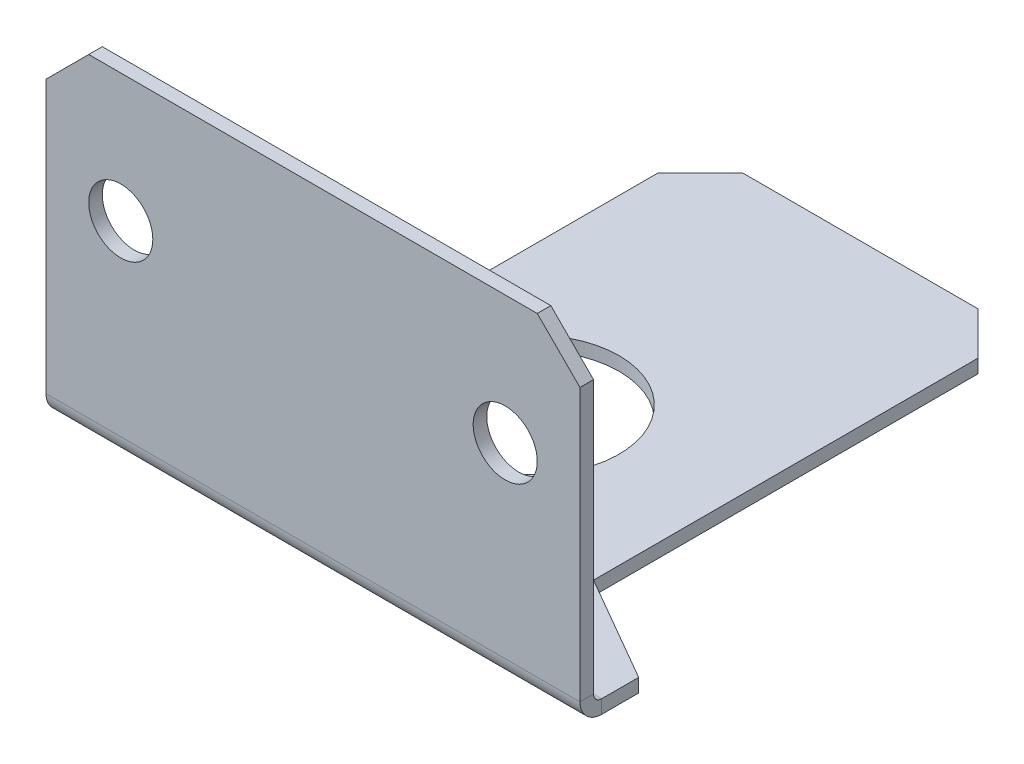
ISO-10303-21;
HEADER;
FILE_DESCRIPTION(('STEP AP214'),'2;1');
FILE_NAME('part.step','',(''),(''),'','','');
FILE_SCHEMA(('AUTOMOTIVE_DESIGN { 1 0 10303 214 1 1 1 1 }'));
ENDSEC;
DATA;
#1=APPLICATION_CONTEXT('core data for automotive mechanical design processes');
#2=APPLICATION_PROTOCOL_DEFINITION('international standard','automotive_design',2000,#1);
#3=PRODUCT_CONTEXT('',#1,'mechanical');
#4=PRODUCT('Part','Part','',(#3));
#5=PRODUCT_RELATED_PRODUCT_CATEGORY('part','',(#4));
#6=PRODUCT_DEFINITION_FORMATION('','',#4);
#7=PRODUCT_DEFINITION_CONTEXT('part definition',#1,'design');
#8=PRODUCT_DEFINITION('design','',#6,#7);
#9=PRODUCT_DEFINITION_SHAPE('','',#8);
#10=(LENGTH_UNIT() NAMED_UNIT(*) SI_UNIT(.MILLI.,.METRE.));
#11=(NAMED_UNIT(*) PLANE_ANGLE_UNIT() SI_UNIT($,.RADIAN.));
#12=(NAMED_UNIT(*) SI_UNIT($,.STERADIAN.) SOLID_ANGLE_UNIT());
#13=UNCERTAINTY_MEASURE_WITH_UNIT(LENGTH_MEASURE(1.E-05),#10,'distance_accuracy_value','');
#14=(GEOMETRIC_REPRESENTATION_CONTEXT(3) GLOBAL_UNCERTAINTY_ASSIGNED_CONTEXT((#13)) GLOBAL_UNIT_ASSIGNED_CONTEXT((#10,
#11,#12)) REPRESENTATION_CONTEXT('',''));
#15=CARTESIAN_POINT('',(0.,0.,0.));
#16=DIRECTION('',(0.,0.,1.));
#17=DIRECTION('',(1.,0.,0.));
#18=AXIS2_PLACEMENT_3D('',#15,#16,#17);
#19=CARTESIAN_POINT('',(12.5,-9.12999999999999,-0.381000000000002));
#20=DIRECTION('',(1.,0.,0.));
#21=DIRECTION('',(0.,0.,-1.));
#22=AXIS2_PLACEMENT_3D('',#19,#20,#21);
#23=PLANE('',#22);
#24=DIRECTION('',(0.,-1.,0.));
#25=VECTOR('',#24,1.);
#26=CARTESIAN_POINT('',(12.5,-9.12999999999999,-0.381000000000002));
#27=LINE('',#26,#25);
#28=CARTESIAN_POINT('',(12.5,-9.12999999999999,-0.381000000000002));
#29=VERTEX_POINT('',#28);
#30=CARTESIAN_POINT('',(12.5,-9.76499999999999,-0.381000000000002));
#31=VERTEX_POINT('',#30);
#32=EDGE_CURVE('E246',#29,#31,#27,.T.);
#33=ORIENTED_EDGE('',*,*,#32,.F.);
#34=CARTESIAN_POINT('',(12.5,-8.74899999999999,-0.381000000000002));
#35=DIRECTION('',(-1.,0.,0.));
#36=DIRECTION('',(0.,0.,1.));
#37=AXIS2_PLACEMENT_3D('',#34,#35,#36);
#38=CIRCLE('',#37,0.381);
#39=CARTESIAN_POINT('',(12.5,-8.74899999999999,0.));
#40=VERTEX_POINT('',#39);
#41=EDGE_CURVE('E190',#40,#29,#38,.F.);
#42=ORIENTED_EDGE('',*,*,#41,.F.);
#43=DIRECTION('',(0.,0.,-1.));
#44=VECTOR('',#43,1.);
#45=CARTESIAN_POINT('',(12.5,-8.74899999999999,0.634999999999998));
#46=LINE('',#45,#44);
#47=CARTESIAN_POINT('',(12.5,-8.74899999999999,0.634999999999998));
#48=VERTEX_POINT('',#47);
#49=EDGE_CURVE('E243',#48,#40,#46,.T.);
#50=ORIENTED_EDGE('',*,*,#49,.F.);
#51=CARTESIAN_POINT('',(12.5,-8.74899999999999,-0.381000000000002));
#52=DIRECTION('',(1.,0.,0.));
#53=DIRECTION('',(0.,0.,-1.));
#54=AXIS2_PLACEMENT_3D('',#51,#52,#53);
#55=CIRCLE('',#54,1.016);
#56=EDGE_CURVE('E201',#48,#31,#55,.T.);
#57=ORIENTED_EDGE('',*,*,#56,.T.);
#58=EDGE_LOOP('',(#33,#42,#50,#57));
#59=FACE_BOUND('',#58,.T.);
#60=ADVANCED_FACE('F48',(#59),#23,.T.);
#61=CARTESIAN_POINT('',(12.5,-8.74899999999999,0.634999999999998));
#62=DIRECTION('',(1.,0.,0.));
#63=DIRECTION('',(0.,0.,-1.));
#64=AXIS2_PLACEMENT_3D('',#61,#62,#63);
#65=PLANE('',#64);
#66=DIRECTION('',(0.,-1.,0.));
#67=VECTOR('',#66,1.);
#68=CARTESIAN_POINT('',(12.5,-9.12999999999999,-2.11324865405187));
#69=LINE('',#68,#67);
#70=CARTESIAN_POINT('',(12.5,-9.12999999999999,-2.11324865405187));
#71=VERTEX_POINT('',#70);
#72=CARTESIAN_POINT('',(12.5,-9.76499999999999,-2.11324865405187));
#73=VERTEX_POINT('',#72);
#74=EDGE_CURVE('E165',#71,#73,#69,.T.);
#75=ORIENTED_EDGE('',*,*,#74,.F.);
#76=DIRECTION('',(0.,0.,-1.));
#77=VECTOR('',#76,1.);
#78=CARTESIAN_POINT('',(12.5,-9.12999999999999,0.));
#79=LINE('',#78,#77);
#80=EDGE_CURVE('E178',#29,#71,#79,.T.);
#81=ORIENTED_EDGE('',*,*,#80,.F.);
#82=ORIENTED_EDGE('',*,*,#32,.T.);
#83=DIRECTION('',(0.,0.,-1.));
#84=VECTOR('',#83,1.);
#85=CARTESIAN_POINT('',(12.5,-9.76499999999999,0.));
#86=LINE('',#85,#84);
#87=EDGE_CURVE('E181',#31,#73,#86,.T.);
#88=ORIENTED_EDGE('',*,*,#87,.T.);
#89=EDGE_LOOP('',(#75,#81,#82,#88));
#90=FACE_BOUND('',#89,.T.);
#91=ADVANCED_FACE('F177',(#90),#65,.T.);
#92=CARTESIAN_POINT('',(-12.5,-8.74899999999999,0.));
#93=DIRECTION('',(-1.,0.,0.));
#94=DIRECTION('',(0.,0.,1.));
#95=AXIS2_PLACEMENT_3D('',#92,#93,#94);
#96=PLANE('',#95);
#97=DIRECTION('',(0.,0.,1.));
#98=VECTOR('',#97,1.);
#99=CARTESIAN_POINT('',(-12.5,-8.74899999999999,0.));
#100=LINE('',#99,#98);
#101=CARTESIAN_POINT('',(-12.5,-8.74899999999999,0.));
#102=VERTEX_POINT('',#101);
#103=CARTESIAN_POINT('',(-12.5,-8.74899999999999,0.634999999999998));
#104=VERTEX_POINT('',#103);
#105=EDGE_CURVE('E240',#102,#104,#100,.T.);
#106=ORIENTED_EDGE('',*,*,#105,.F.);
#107=CARTESIAN_POINT('',(-12.5,-8.74899999999999,-0.381000000000002));
#108=DIRECTION('',(-1.,0.,0.));
#109=DIRECTION('',(0.,0.,1.));
#110=AXIS2_PLACEMENT_3D('',#107,#108,#109);
#111=CIRCLE('',#110,0.381);
#112=CARTESIAN_POINT('',(-12.5,-9.12999999999999,-0.381000000000002));
#113=VERTEX_POINT('',#112);
#114=EDGE_CURVE('E211',#102,#113,#111,.F.);
#115=ORIENTED_EDGE('',*,*,#114,.T.);
#116=DIRECTION('',(0.,1.,0.));
#117=VECTOR('',#116,1.);
#118=CARTESIAN_POINT('',(-12.5,-9.76499999999999,-0.381000000000002));
#119=LINE('',#118,#117);
#120=CARTESIAN_POINT('',(-12.5,-9.76499999999999,-0.381000000000002));
#121=VERTEX_POINT('',#120);
#122=EDGE_CURVE('E238',#121,#113,#119,.T.);
#123=ORIENTED_EDGE('',*,*,#122,.F.);
#124=CARTESIAN_POINT('',(-12.5,-8.74899999999999,-0.381000000000002));
#125=DIRECTION('',(1.,0.,0.));
#126=DIRECTION('',(0.,0.,-1.));
#127=AXIS2_PLACEMENT_3D('',#124,#125,#126);
#128=CIRCLE('',#127,1.016);
#129=EDGE_CURVE('E194',#104,#121,#128,.T.);
#130=ORIENTED_EDGE('',*,*,#129,.F.);
#131=EDGE_LOOP('',(#106,#115,#123,#130));
#132=FACE_BOUND('',#131,.T.);
#133=ADVANCED_FACE('F293',(#132),#96,.T.);
#134=CARTESIAN_POINT('',(-12.5,-9.76499999999999,-0.381000000000002));
#135=DIRECTION('',(-1.,0.,0.));
#136=DIRECTION('',(0.,0.,1.));
#137=AXIS2_PLACEMENT_3D('',#134,#135,#136);
#138=PLANE('',#137);
#139=DIRECTION('',(0.,-1.,0.));
#140=VECTOR('',#139,1.);
#141=CARTESIAN_POINT('',(-12.5,6.,0.635));
#142=LINE('',#141,#140);
#143=CARTESIAN_POINT('',(-12.5,4.,0.635));
#144=VERTEX_POINT('',#143);
#145=EDGE_CURVE('E216',#144,#104,#142,.T.);
#146=ORIENTED_EDGE('',*,*,#145,.F.);
#147=DIRECTION('',(0.,0.,-1.));
#148=VECTOR('',#147,1.);
#149=CARTESIAN_POINT('',(-12.5,4.,-0.381000000000002));
#150=LINE('',#149,#148);
#151=CARTESIAN_POINT('',(-12.5,4.,0.));
#152=VERTEX_POINT('',#151);
#153=EDGE_CURVE('E275',#144,#152,#150,.T.);
#154=ORIENTED_EDGE('',*,*,#153,.T.);
#155=DIRECTION('',(0.,-1.,0.));
#156=VECTOR('',#155,1.);
#157=CARTESIAN_POINT('',(-12.5,6.,0.));
#158=LINE('',#157,#156);
#159=EDGE_CURVE('E214',#152,#102,#158,.T.);
#160=ORIENTED_EDGE('',*,*,#159,.T.);
#161=ORIENTED_EDGE('',*,*,#105,.T.);
#162=EDGE_LOOP('',(#146,#154,#160,#161));
#163=FACE_BOUND('',#162,.T.);
#164=ADVANCED_FACE('F281',(#163),#138,.T.);
#165=CARTESIAN_POINT('',(12.5,-9.76499999999999,0.));
#166=DIRECTION('',(0.,1.,0.));
#167=DIRECTION('',(0.,0.,1.));
#168=AXIS2_PLACEMENT_3D('',#165,#166,#167);
#169=PLANE('',#168);
#170=CARTESIAN_POINT('',(-1.00744143311319,-9.76499999999999,-10.7));
#171=DIRECTION('',(0.,-1.,0.));
#172=DIRECTION('',(0.,0.,-1.));
#173=AXIS2_PLACEMENT_3D('',#170,#171,#172);
#174=CIRCLE('',#173,4.);
#175=CARTESIAN_POINT('',(-1.00744143311319,-9.76499999999999,-14.7));
#176=VERTEX_POINT('',#175);
#177=EDGE_CURVE('E364',#176,#176,#174,.T.);
#178=ORIENTED_EDGE('',*,*,#177,.F.);
#179=EDGE_LOOP('',(#178));
#180=FACE_BOUND('',#179,.T.);
#181=DIRECTION('',(0.,0.,1.));
#182=VECTOR('',#181,1.);
#183=CARTESIAN_POINT('',(-7.5,-9.76499999999999,-25.));
#184=LINE('',#183,#182);
#185=CARTESIAN_POINT('',(-7.5,-9.76499999999999,-23.));
#186=VERTEX_POINT('',#185);
#187=CARTESIAN_POINT('',(-7.5,-9.76499999999999,-5.00000000000001));
#188=VERTEX_POINT('',#187);
#189=EDGE_CURVE('E354',#186,#188,#184,.T.);
#190=ORIENTED_EDGE('',*,*,#189,.F.);
#191=DIRECTION('',(0.707106781186548,0.,-0.707106781186548));
#192=VECTOR('',#191,1.);
#193=CARTESIAN_POINT('',(-7.5,-9.76499999999999,-23.));
#194=LINE('',#193,#192);
#195=CARTESIAN_POINT('',(-5.5,-9.76499999999999,-25.));
#196=VERTEX_POINT('',#195);
#197=EDGE_CURVE('E269',#186,#196,#194,.T.);
#198=ORIENTED_EDGE('',*,*,#197,.T.);
#199=DIRECTION('',(-1.,0.,0.));
#200=VECTOR('',#199,1.);
#201=CARTESIAN_POINT('',(12.5,-9.76499999999999,-25.));
#202=LINE('',#201,#200);
#203=CARTESIAN_POINT('',(5.50000000000001,-9.76499999999999,-25.));
#204=VERTEX_POINT('',#203);
#205=EDGE_CURVE('E235',#204,#196,#202,.T.);
#206=ORIENTED_EDGE('',*,*,#205,.F.);
#207=DIRECTION('',(0.707106781186548,0.,0.707106781186547));
#208=VECTOR('',#207,1.);
#209=CARTESIAN_POINT('',(5.50000000000001,-9.76499999999999,-25.));
#210=LINE('',#209,#208);
#211=CARTESIAN_POINT('',(7.50000000000001,-9.76499999999999,-23.));
#212=VERTEX_POINT('',#211);
#213=EDGE_CURVE('E260',#204,#212,#210,.T.);
#214=ORIENTED_EDGE('',*,*,#213,.T.);
#215=DIRECTION('',(0.,0.,-1.));
#216=VECTOR('',#215,1.);
#217=CARTESIAN_POINT('',(7.50000000000001,-9.76499999999999,-25.));
#218=LINE('',#217,#216);
#219=CARTESIAN_POINT('',(7.5,-9.76499999999999,-5.00000000000001));
#220=VERTEX_POINT('',#219);
#221=EDGE_CURVE('E172',#220,#212,#218,.T.);
#222=ORIENTED_EDGE('',*,*,#221,.F.);
#223=DIRECTION('',(-0.866025403784438,0.,-0.500000000000002));
#224=VECTOR('',#223,1.);
#225=CARTESIAN_POINT('',(12.5,-9.76499999999999,-2.11324865405187));
#226=LINE('',#225,#224);
#227=EDGE_CURVE('E361',#73,#220,#226,.T.);
#228=ORIENTED_EDGE('',*,*,#227,.F.);
#229=ORIENTED_EDGE('',*,*,#87,.F.);
#230=DIRECTION('',(-1.,0.,0.));
#231=VECTOR('',#230,1.);
#232=CARTESIAN_POINT('',(12.5,-9.76499999999999,-0.381000000000002));
#233=LINE('',#232,#231);
#234=EDGE_CURVE('E204',#31,#121,#233,.T.);
#235=ORIENTED_EDGE('',*,*,#234,.T.);
#236=DIRECTION('',(0.,0.,-1.));
#237=VECTOR('',#236,1.);
#238=CARTESIAN_POINT('',(-12.5,-9.76499999999999,0.));
#239=LINE('',#238,#237);
#240=CARTESIAN_POINT('',(-12.5,-9.76499999999999,-2.11324865405187));
#241=VERTEX_POINT('',#240);
#242=EDGE_CURVE('E205',#121,#241,#239,.T.);
#243=ORIENTED_EDGE('',*,*,#242,.T.);
#244=DIRECTION('',(-0.866025403784438,0.,0.500000000000001));
#245=VECTOR('',#244,1.);
#246=CARTESIAN_POINT('',(-7.5,-9.76499999999999,-5.00000000000001));
#247=LINE('',#246,#245);
#248=EDGE_CURVE('E357',#188,#241,#247,.T.);
#249=ORIENTED_EDGE('',*,*,#248,.F.);
#250=EDGE_LOOP('',(#190,#198,#206,#214,#222,#228,#229,#235,#243,#249));
#251=FACE_BOUND('',#250,.T.);
#252=ADVANCED_FACE('F391',(#180,#251),#169,.F.);
#253=CARTESIAN_POINT('',(12.5,-9.12999999999999,-25.));
#254=DIRECTION('',(0.,0.,-1.));
#255=DIRECTION('',(-1.,0.,0.));
#256=AXIS2_PLACEMENT_3D('',#253,#254,#255);
#257=PLANE('',#256);
#258=ORIENTED_EDGE('',*,*,#205,.T.);
#259=DIRECTION('',(0.,1.,0.));
#260=VECTOR('',#259,1.);
#261=CARTESIAN_POINT('',(-5.5,-9.12999999999999,-25.));
#262=LINE('',#261,#260);
#263=CARTESIAN_POINT('',(-5.5,-9.12999999999999,-25.));
#264=VERTEX_POINT('',#263);
#265=EDGE_CURVE('E271',#196,#264,#262,.T.);
#266=ORIENTED_EDGE('',*,*,#265,.T.);
#267=DIRECTION('',(-1.,0.,0.));
#268=VECTOR('',#267,1.);
#269=CARTESIAN_POINT('',(12.5,-9.12999999999999,-25.));
#270=LINE('',#269,#268);
#271=CARTESIAN_POINT('',(5.50000000000001,-9.12999999999999,-25.));
#272=VERTEX_POINT('',#271);
#273=EDGE_CURVE('E233',#272,#264,#270,.T.);
#274=ORIENTED_EDGE('',*,*,#273,.F.);
#275=DIRECTION('',(0.,-1.,0.));
#276=VECTOR('',#275,1.);
#277=CARTESIAN_POINT('',(5.50000000000001,-9.76499999999999,-25.));
#278=LINE('',#277,#276);
#279=EDGE_CURVE('E257',#272,#204,#278,.T.);
#280=ORIENTED_EDGE('',*,*,#279,.T.);
#281=EDGE_LOOP('',(#258,#266,#274,#280));
#282=FACE_BOUND('',#281,.T.);
#283=ADVANCED_FACE('F335',(#282),#257,.T.);
#284=CARTESIAN_POINT('',(12.5,-9.12999999999999,0.));
#285=DIRECTION('',(0.,1.,0.));
#286=DIRECTION('',(0.,0.,1.));
#287=AXIS2_PLACEMENT_3D('',#284,#285,#286);
#288=PLANE('',#287);
#289=ORIENTED_EDGE('',*,*,#273,.T.);
#290=DIRECTION('',(-0.707106781186548,0.,0.707106781186548));
#291=VECTOR('',#290,1.);
#292=CARTESIAN_POINT('',(-9.00000000000001,-9.12999999999999,-21.5));
#293=LINE('',#292,#291);
#294=CARTESIAN_POINT('',(-7.5,-9.12999999999999,-23.));
#295=VERTEX_POINT('',#294);
#296=EDGE_CURVE('E273',#264,#295,#293,.T.);
#297=ORIENTED_EDGE('',*,*,#296,.T.);
#298=DIRECTION('',(0.,0.,1.));
#299=VECTOR('',#298,1.);
#300=CARTESIAN_POINT('',(-7.5,-9.12999999999999,-25.));
#301=LINE('',#300,#299);
#302=CARTESIAN_POINT('',(-7.5,-9.12999999999999,-5.00000000000001));
#303=VERTEX_POINT('',#302);
#304=EDGE_CURVE('E341',#295,#303,#301,.T.);
#305=ORIENTED_EDGE('',*,*,#304,.T.);
#306=DIRECTION('',(-0.866025403784438,0.,0.500000000000001));
#307=VECTOR('',#306,1.);
#308=CARTESIAN_POINT('',(-7.5,-9.12999999999999,-5.00000000000001));
#309=LINE('',#308,#307);
#310=CARTESIAN_POINT('',(-12.5,-9.12999999999999,-2.11324865405187));
#311=VERTEX_POINT('',#310);
#312=EDGE_CURVE('E350',#303,#311,#309,.T.);
#313=ORIENTED_EDGE('',*,*,#312,.T.);
#314=DIRECTION('',(0.,0.,-1.));
#315=VECTOR('',#314,1.);
#316=CARTESIAN_POINT('',(-12.5,-9.12999999999999,0.));
#317=LINE('',#316,#315);
#318=EDGE_CURVE('E208',#113,#311,#317,.T.);
#319=ORIENTED_EDGE('',*,*,#318,.F.);
#320=DIRECTION('',(-1.,0.,0.));
#321=VECTOR('',#320,1.);
#322=CARTESIAN_POINT('',(12.5,-9.12999999999999,-0.381000000000002));
#323=LINE('',#322,#321);
#324=EDGE_CURVE('E189',#29,#113,#323,.T.);
#325=ORIENTED_EDGE('',*,*,#324,.F.);
#326=ORIENTED_EDGE('',*,*,#80,.T.);
#327=DIRECTION('',(-0.866025403784438,0.,-0.500000000000002));
#328=VECTOR('',#327,1.);
#329=CARTESIAN_POINT('',(12.5,-9.12999999999999,-2.11324865405187));
#330=LINE('',#329,#328);
#331=CARTESIAN_POINT('',(7.5,-9.12999999999999,-5.00000000000001));
#332=VERTEX_POINT('',#331);
#333=EDGE_CURVE('E161',#71,#332,#330,.T.);
#334=ORIENTED_EDGE('',*,*,#333,.T.);
#335=DIRECTION('',(0.,0.,-1.));
#336=VECTOR('',#335,1.);
#337=CARTESIAN_POINT('',(7.50000000000001,-9.12999999999999,-25.));
#338=LINE('',#337,#336);
#339=CARTESIAN_POINT('',(7.50000000000001,-9.12999999999999,-23.));
#340=VERTEX_POINT('',#339);
#341=EDGE_CURVE('E171',#332,#340,#338,.T.);
#342=ORIENTED_EDGE('',*,*,#341,.T.);
#343=DIRECTION('',(-0.707106781186548,0.,-0.707106781186547));
#344=VECTOR('',#343,1.);
#345=CARTESIAN_POINT('',(21.5,-9.12999999999999,-9.00000000000001));
#346=LINE('',#345,#344);
#347=EDGE_CURVE('E264',#340,#272,#346,.T.);
#348=ORIENTED_EDGE('',*,*,#347,.T.);
#349=EDGE_LOOP('',(#289,#297,#305,#313,#319,#325,#326,#334,#342,#348));
#350=FACE_BOUND('',#349,.T.);
#351=CARTESIAN_POINT('',(-1.00744143311319,-9.12999999999999,-10.7));
#352=DIRECTION('',(0.,-1.,0.));
#353=DIRECTION('',(0.,0.,-1.));
#354=AXIS2_PLACEMENT_3D('',#351,#352,#353);
#355=CIRCLE('',#354,4.);
#356=CARTESIAN_POINT('',(-1.00744143311319,-9.12999999999999,-14.7));
#357=VERTEX_POINT('',#356);
#358=EDGE_CURVE('E359',#357,#357,#355,.T.);
#359=ORIENTED_EDGE('',*,*,#358,.T.);
#360=EDGE_LOOP('',(#359));
#361=FACE_BOUND('',#360,.T.);
#362=ADVANCED_FACE('F185',(#350,#361),#288,.T.);
#363=CARTESIAN_POINT('',(12.5,-8.74899999999999,-0.381000000000002));
#364=DIRECTION('',(-1.,0.,0.));
#365=DIRECTION('',(0.,0.,1.));
#366=AXIS2_PLACEMENT_3D('',#363,#364,#365);
#367=CYLINDRICAL_SURFACE('',#366,0.381);
#368=ORIENTED_EDGE('',*,*,#114,.F.);
#369=DIRECTION('',(-1.,0.,0.));
#370=VECTOR('',#369,1.);
#371=CARTESIAN_POINT('',(12.5,-8.74899999999999,0.));
#372=LINE('',#371,#370);
#373=EDGE_CURVE('E229',#40,#102,#372,.T.);
#374=ORIENTED_EDGE('',*,*,#373,.F.);
#375=ORIENTED_EDGE('',*,*,#41,.T.);
#376=ORIENTED_EDGE('',*,*,#324,.T.);
#377=EDGE_LOOP('',(#368,#374,#375,#376));
#378=FACE_BOUND('',#377,.T.);
#379=ADVANCED_FACE('F291',(#378),#367,.F.);
#380=CARTESIAN_POINT('',(12.5,6.,0.));
#381=DIRECTION('',(0.,0.,-1.));
#382=DIRECTION('',(0.,1.,0.));
#383=AXIS2_PLACEMENT_3D('',#380,#381,#382);
#384=PLANE('',#383);
#385=CARTESIAN_POINT('',(9.,0.,0.));
#386=DIRECTION('',(0.,0.,1.));
#387=DIRECTION('',(1.,0.,0.));
#388=AXIS2_PLACEMENT_3D('',#385,#386,#387);
#389=CIRCLE('',#388,1.5);
#390=CARTESIAN_POINT('',(10.5,0.,0.));
#391=VERTEX_POINT('',#390);
#392=EDGE_CURVE('E366',#391,#391,#389,.T.);
#393=ORIENTED_EDGE('',*,*,#392,.T.);
#394=EDGE_LOOP('',(#393));
#395=FACE_BOUND('',#394,.T.);
#396=CARTESIAN_POINT('',(-9.,0.,0.));
#397=DIRECTION('',(0.,0.,1.));
#398=DIRECTION('',(1.,0.,0.));
#399=AXIS2_PLACEMENT_3D('',#396,#397,#398);
#400=CIRCLE('',#399,1.5);
#401=CARTESIAN_POINT('',(-7.5,0.,0.));
#402=VERTEX_POINT('',#401);
#403=EDGE_CURVE('E375',#402,#402,#400,.T.);
#404=ORIENTED_EDGE('',*,*,#403,.T.);
#405=EDGE_LOOP('',(#404));
#406=FACE_BOUND('',#405,.T.);
#407=ORIENTED_EDGE('',*,*,#159,.F.);
#408=DIRECTION('',(-0.707106781186548,-0.707106781186547,0.));
#409=VECTOR('',#408,1.);
#410=CARTESIAN_POINT('',(1.00000000000001,17.5,0.));
#411=LINE('',#410,#409);
#412=CARTESIAN_POINT('',(-10.5,6.,0.));
#413=VERTEX_POINT('',#412);
#414=EDGE_CURVE('E70',#152,#413,#411,.F.);
#415=ORIENTED_EDGE('',*,*,#414,.T.);
#416=DIRECTION('',(-1.,0.,0.));
#417=VECTOR('',#416,1.);
#418=CARTESIAN_POINT('',(12.5,6.,0.));
#419=LINE('',#418,#417);
#420=CARTESIAN_POINT('',(10.5,6.,0.));
#421=VERTEX_POINT('',#420);
#422=EDGE_CURVE('E227',#421,#413,#419,.T.);
#423=ORIENTED_EDGE('',*,*,#422,.F.);
#424=DIRECTION('',(0.707106781186548,-0.707106781186548,0.));
#425=VECTOR('',#424,1.);
#426=CARTESIAN_POINT('',(11.5,5.,0.));
#427=LINE('',#426,#425);
#428=CARTESIAN_POINT('',(12.5,4.,0.));
#429=VERTEX_POINT('',#428);
#430=EDGE_CURVE('E251',#421,#429,#427,.T.);
#431=ORIENTED_EDGE('',*,*,#430,.T.);
#432=DIRECTION('',(0.,-1.,0.));
#433=VECTOR('',#432,1.);
#434=CARTESIAN_POINT('',(12.5,6.,0.));
#435=LINE('',#434,#433);
#436=EDGE_CURVE('E192',#429,#40,#435,.T.);
#437=ORIENTED_EDGE('',*,*,#436,.T.);
#438=ORIENTED_EDGE('',*,*,#373,.T.);
#439=EDGE_LOOP('',(#407,#415,#423,#431,#437,#438));
#440=FACE_BOUND('',#439,.T.);
#441=ADVANCED_FACE('F285',(#395,#406,#440),#384,.T.);
#442=CARTESIAN_POINT('',(12.5,6.,0.635));
#443=DIRECTION('',(0.,1.,0.));
#444=DIRECTION('',(0.,0.,1.));
#445=AXIS2_PLACEMENT_3D('',#442,#443,#444);
#446=PLANE('',#445);
#447=ORIENTED_EDGE('',*,*,#422,.T.);
#448=DIRECTION('',(0.,0.,1.));
#449=VECTOR('',#448,1.);
#450=CARTESIAN_POINT('',(-10.5,6.,0.635));
#451=LINE('',#450,#449);
#452=CARTESIAN_POINT('',(-10.5,6.,0.635));
#453=VERTEX_POINT('',#452);
#454=EDGE_CURVE('E56',#413,#453,#451,.T.);
#455=ORIENTED_EDGE('',*,*,#454,.T.);
#456=DIRECTION('',(-1.,0.,0.));
#457=VECTOR('',#456,1.);
#458=CARTESIAN_POINT('',(12.5,6.,0.635));
#459=LINE('',#458,#457);
#460=CARTESIAN_POINT('',(10.5,6.,0.635));
#461=VERTEX_POINT('',#460);
#462=EDGE_CURVE('E225',#461,#453,#459,.T.);
#463=ORIENTED_EDGE('',*,*,#462,.F.);
#464=DIRECTION('',(0.,0.,-1.));
#465=VECTOR('',#464,1.);
#466=CARTESIAN_POINT('',(10.5,6.,0.));
#467=LINE('',#466,#465);
#468=EDGE_CURVE('E248',#461,#421,#467,.T.);
#469=ORIENTED_EDGE('',*,*,#468,.T.);
#470=EDGE_LOOP('',(#447,#455,#463,#469));
#471=FACE_BOUND('',#470,.T.);
#472=ADVANCED_FACE('F414',(#471),#446,.T.);
#473=CARTESIAN_POINT('',(12.5,6.,0.635));
#474=DIRECTION('',(0.,0.,-1.));
#475=DIRECTION('',(0.,1.,0.));
#476=AXIS2_PLACEMENT_3D('',#473,#474,#475);
#477=PLANE('',#476);
#478=CARTESIAN_POINT('',(9.,0.,0.634999999999999));
#479=DIRECTION('',(0.,0.,1.));
#480=DIRECTION('',(1.,0.,0.));
#481=AXIS2_PLACEMENT_3D('',#478,#479,#480);
#482=CIRCLE('',#481,1.5);
#483=CARTESIAN_POINT('',(10.5,0.,0.634999999999999));
#484=VERTEX_POINT('',#483);
#485=EDGE_CURVE('E370',#484,#484,#482,.T.);
#486=ORIENTED_EDGE('',*,*,#485,.F.);
#487=EDGE_LOOP('',(#486));
#488=FACE_BOUND('',#487,.T.);
#489=CARTESIAN_POINT('',(-9.,0.,0.634999999999999));
#490=DIRECTION('',(0.,0.,1.));
#491=DIRECTION('',(1.,0.,0.));
#492=AXIS2_PLACEMENT_3D('',#489,#490,#491);
#493=CIRCLE('',#492,1.5);
#494=CARTESIAN_POINT('',(-7.5,0.,0.634999999999999));
#495=VERTEX_POINT('',#494);
#496=EDGE_CURVE('E380',#495,#495,#493,.T.);
#497=ORIENTED_EDGE('',*,*,#496,.F.);
#498=EDGE_LOOP('',(#497));
#499=FACE_BOUND('',#498,.T.);
#500=ORIENTED_EDGE('',*,*,#462,.T.);
#501=DIRECTION('',(0.707106781186548,0.707106781186547,0.));
#502=VECTOR('',#501,1.);
#503=CARTESIAN_POINT('',(-12.5,4.,0.635));
#504=LINE('',#503,#502);
#505=EDGE_CURVE('E13',#453,#144,#504,.F.);
#506=ORIENTED_EDGE('',*,*,#505,.T.);
#507=ORIENTED_EDGE('',*,*,#145,.T.);
#508=DIRECTION('',(-1.,0.,0.));
#509=VECTOR('',#508,1.);
#510=CARTESIAN_POINT('',(12.5,-8.74899999999999,0.634999999999998));
#511=LINE('',#510,#509);
#512=EDGE_CURVE('E222',#48,#104,#511,.T.);
#513=ORIENTED_EDGE('',*,*,#512,.F.);
#514=DIRECTION('',(0.,-1.,0.));
#515=VECTOR('',#514,1.);
#516=CARTESIAN_POINT('',(12.5,6.,0.635));
#517=LINE('',#516,#515);
#518=CARTESIAN_POINT('',(12.5,4.,0.635));
#519=VERTEX_POINT('',#518);
#520=EDGE_CURVE('E199',#519,#48,#517,.T.);
#521=ORIENTED_EDGE('',*,*,#520,.F.);
#522=DIRECTION('',(-0.707106781186548,0.707106781186548,0.));
#523=VECTOR('',#522,1.);
#524=CARTESIAN_POINT('',(10.5,6.,0.635));
#525=LINE('',#524,#523);
#526=EDGE_CURVE('E255',#519,#461,#525,.T.);
#527=ORIENTED_EDGE('',*,*,#526,.T.);
#528=EDGE_LOOP('',(#500,#506,#507,#513,#521,#527));
#529=FACE_BOUND('',#528,.T.);
#530=ADVANCED_FACE('F302',(#488,#499,#529),#477,.F.);
#531=CARTESIAN_POINT('',(12.5,-8.74899999999999,-0.381000000000002));
#532=DIRECTION('',(-1.,0.,0.));
#533=DIRECTION('',(0.,0.,1.));
#534=AXIS2_PLACEMENT_3D('',#531,#532,#533);
#535=CYLINDRICAL_SURFACE('',#534,1.016);
#536=ORIENTED_EDGE('',*,*,#129,.T.);
#537=ORIENTED_EDGE('',*,*,#234,.F.);
#538=ORIENTED_EDGE('',*,*,#56,.F.);
#539=ORIENTED_EDGE('',*,*,#512,.T.);
#540=EDGE_LOOP('',(#536,#537,#538,#539));
#541=FACE_BOUND('',#540,.T.);
#542=ADVANCED_FACE('F298',(#541),#535,.T.);
#543=CARTESIAN_POINT('',(12.5,-8.74899999999999,-0.381000000000002));
#544=DIRECTION('',(-1.,0.,0.));
#545=DIRECTION('',(0.,0.,1.));
#546=AXIS2_PLACEMENT_3D('',#543,#544,#545);
#547=PLANE('',#546);
#548=ORIENTED_EDGE('',*,*,#436,.F.);
#549=DIRECTION('',(0.,0.,1.));
#550=VECTOR('',#549,1.);
#551=CARTESIAN_POINT('',(12.5,4.,0.635));
#552=LINE('',#551,#550);
#553=EDGE_CURVE('E253',#429,#519,#552,.T.);
#554=ORIENTED_EDGE('',*,*,#553,.T.);
#555=ORIENTED_EDGE('',*,*,#520,.T.);
#556=ORIENTED_EDGE('',*,*,#49,.T.);
#557=EDGE_LOOP('',(#548,#554,#555,#556));
#558=FACE_BOUND('',#557,.T.);
#559=ADVANCED_FACE('F399',(#558),#547,.F.);
#560=CARTESIAN_POINT('',(-12.5,-8.74899999999999,-0.381000000000002));
#561=DIRECTION('',(-1.,0.,0.));
#562=DIRECTION('',(0.,0.,1.));
#563=AXIS2_PLACEMENT_3D('',#560,#561,#562);
#564=PLANE('',#563);
#565=DIRECTION('',(0.,-1.,0.));
#566=VECTOR('',#565,1.);
#567=CARTESIAN_POINT('',(-12.5,-9.12999999999999,-2.11324865405187));
#568=LINE('',#567,#566);
#569=EDGE_CURVE('E349',#311,#241,#568,.T.);
#570=ORIENTED_EDGE('',*,*,#569,.T.);
#571=ORIENTED_EDGE('',*,*,#242,.F.);
#572=ORIENTED_EDGE('',*,*,#122,.T.);
#573=ORIENTED_EDGE('',*,*,#318,.T.);
#574=EDGE_LOOP('',(#570,#571,#572,#573));
#575=FACE_BOUND('',#574,.T.);
#576=ADVANCED_FACE('F396',(#575),#564,.T.);
#577=CARTESIAN_POINT('',(-7.5,-9.12999999999999,-5.00000000000001));
#578=DIRECTION('',(0.500000000000001,0.,0.866025403784438));
#579=DIRECTION('',(0.866025403784438,0.,-0.500000000000001));
#580=AXIS2_PLACEMENT_3D('',#577,#578,#579);
#581=PLANE('',#580);
#582=ORIENTED_EDGE('',*,*,#248,.T.);
#583=ORIENTED_EDGE('',*,*,#569,.F.);
#584=ORIENTED_EDGE('',*,*,#312,.F.);
#585=DIRECTION('',(0.,-1.,0.));
#586=VECTOR('',#585,1.);
#587=CARTESIAN_POINT('',(-7.5,-9.12999999999999,-5.00000000000001));
#588=LINE('',#587,#586);
#589=EDGE_CURVE('E347',#303,#188,#588,.T.);
#590=ORIENTED_EDGE('',*,*,#589,.T.);
#591=EDGE_LOOP('',(#582,#583,#584,#590));
#592=FACE_BOUND('',#591,.T.);
#593=ADVANCED_FACE('F394',(#592),#581,.F.);
#594=CARTESIAN_POINT('',(-7.5,-9.12999999999999,-25.));
#595=DIRECTION('',(1.,0.,0.));
#596=DIRECTION('',(0.,0.,-1.));
#597=AXIS2_PLACEMENT_3D('',#594,#595,#596);
#598=PLANE('',#597);
#599=ORIENTED_EDGE('',*,*,#304,.F.);
#600=DIRECTION('',(0.,-1.,0.));
#601=VECTOR('',#600,1.);
#602=CARTESIAN_POINT('',(-7.5,-9.76499999999999,-23.));
#603=LINE('',#602,#601);
#604=EDGE_CURVE('E266',#295,#186,#603,.T.);
#605=ORIENTED_EDGE('',*,*,#604,.T.);
#606=ORIENTED_EDGE('',*,*,#189,.T.);
#607=ORIENTED_EDGE('',*,*,#589,.F.);
#608=EDGE_LOOP('',(#599,#605,#606,#607));
#609=FACE_BOUND('',#608,.T.);
#610=ADVANCED_FACE('F344',(#609),#598,.F.);
#611=CARTESIAN_POINT('',(-1.00744143311319,-9.12999999999999,-10.7));
#612=DIRECTION('',(0.,-1.,0.));
#613=DIRECTION('',(0.,0.,-1.));
#614=AXIS2_PLACEMENT_3D('',#611,#612,#613);
#615=CYLINDRICAL_SURFACE('',#614,4.);
#616=ORIENTED_EDGE('',*,*,#358,.F.);
#617=EDGE_LOOP('',(#616));
#618=FACE_BOUND('',#617,.T.);
#619=ORIENTED_EDGE('',*,*,#177,.T.);
#620=EDGE_LOOP('',(#619));
#621=FACE_BOUND('',#620,.T.);
#622=ADVANCED_FACE('F487',(#618,#621),#615,.F.);
#623=CARTESIAN_POINT('',(7.50000000000001,-9.12999999999999,-25.));
#624=DIRECTION('',(-1.,0.,0.));
#625=DIRECTION('',(0.,0.,1.));
#626=AXIS2_PLACEMENT_3D('',#623,#624,#625);
#627=PLANE('',#626);
#628=ORIENTED_EDGE('',*,*,#221,.T.);
#629=DIRECTION('',(0.,1.,0.));
#630=VECTOR('',#629,1.);
#631=CARTESIAN_POINT('',(7.50000000000001,-9.12999999999999,-23.));
#632=LINE('',#631,#630);
#633=EDGE_CURVE('E262',#212,#340,#632,.T.);
#634=ORIENTED_EDGE('',*,*,#633,.T.);
#635=ORIENTED_EDGE('',*,*,#341,.F.);
#636=DIRECTION('',(0.,-1.,0.));
#637=VECTOR('',#636,1.);
#638=CARTESIAN_POINT('',(7.5,-9.12999999999999,-5.00000000000001));
#639=LINE('',#638,#637);
#640=EDGE_CURVE('E167',#332,#220,#639,.T.);
#641=ORIENTED_EDGE('',*,*,#640,.T.);
#642=EDGE_LOOP('',(#628,#634,#635,#641));
#643=FACE_BOUND('',#642,.T.);
#644=ADVANCED_FACE('F388',(#643),#627,.F.);
#645=CARTESIAN_POINT('',(12.5,-9.12999999999999,-2.11324865405187));
#646=DIRECTION('',(-0.500000000000002,0.,0.866025403784438));
#647=DIRECTION('',(0.866025403784438,0.,0.500000000000002));
#648=AXIS2_PLACEMENT_3D('',#645,#646,#647);
#649=PLANE('',#648);
#650=ORIENTED_EDGE('',*,*,#227,.T.);
#651=ORIENTED_EDGE('',*,*,#640,.F.);
#652=ORIENTED_EDGE('',*,*,#333,.F.);
#653=ORIENTED_EDGE('',*,*,#74,.T.);
#654=EDGE_LOOP('',(#650,#651,#652,#653));
#655=FACE_BOUND('',#654,.T.);
#656=ADVANCED_FACE('F164',(#655),#649,.F.);
#657=CARTESIAN_POINT('',(-9.,0.,0.));
#658=DIRECTION('',(0.,0.,1.));
#659=DIRECTION('',(1.,0.,0.));
#660=AXIS2_PLACEMENT_3D('',#657,#658,#659);
#661=CYLINDRICAL_SURFACE('',#660,1.5);
#662=ORIENTED_EDGE('',*,*,#403,.F.);
#663=EDGE_LOOP('',(#662));
#664=FACE_BOUND('',#663,.T.);
#665=ORIENTED_EDGE('',*,*,#496,.T.);
#666=EDGE_LOOP('',(#665));
#667=FACE_BOUND('',#666,.T.);
#668=ADVANCED_FACE('F539',(#664,#667),#661,.F.);
#669=CARTESIAN_POINT('',(9.,0.,0.));
#670=DIRECTION('',(0.,0.,1.));
#671=DIRECTION('',(1.,0.,0.));
#672=AXIS2_PLACEMENT_3D('',#669,#670,#671);
#673=CYLINDRICAL_SURFACE('',#672,1.5);
#674=ORIENTED_EDGE('',*,*,#392,.F.);
#675=EDGE_LOOP('',(#674));
#676=FACE_BOUND('',#675,.T.);
#677=ORIENTED_EDGE('',*,*,#485,.T.);
#678=EDGE_LOOP('',(#677));
#679=FACE_BOUND('',#678,.T.);
#680=ADVANCED_FACE('F323',(#676,#679),#673,.F.);
#681=CARTESIAN_POINT('',(10.5,6.,0.635));
#682=DIRECTION('',(0.707106781186548,0.707106781186548,0.));
#683=DIRECTION('',(0.,0.,1.));
#684=AXIS2_PLACEMENT_3D('',#681,#682,#683);
#685=PLANE('',#684);
#686=ORIENTED_EDGE('',*,*,#526,.F.);
#687=ORIENTED_EDGE('',*,*,#553,.F.);
#688=ORIENTED_EDGE('',*,*,#430,.F.);
#689=ORIENTED_EDGE('',*,*,#468,.F.);
#690=EDGE_LOOP('',(#686,#687,#688,#689));
#691=FACE_BOUND('',#690,.T.);
#692=ADVANCED_FACE('F320',(#691),#685,.T.);
#693=CARTESIAN_POINT('',(5.50000000000001,-9.12999999999999,-25.));
#694=DIRECTION('',(0.707106781186547,0.,-0.707106781186548));
#695=DIRECTION('',(0.,1.,0.));
#696=AXIS2_PLACEMENT_3D('',#693,#694,#695);
#697=PLANE('',#696);
#698=ORIENTED_EDGE('',*,*,#347,.F.);
#699=ORIENTED_EDGE('',*,*,#633,.F.);
#700=ORIENTED_EDGE('',*,*,#213,.F.);
#701=ORIENTED_EDGE('',*,*,#279,.F.);
#702=EDGE_LOOP('',(#698,#699,#700,#701));
#703=FACE_BOUND('',#702,.T.);
#704=ADVANCED_FACE('F309',(#703),#697,.T.);
#705=CARTESIAN_POINT('',(-7.5,-9.12999999999999,-23.));
#706=DIRECTION('',(-0.707106781186548,0.,-0.707106781186548));
#707=DIRECTION('',(0.,1.,0.));
#708=AXIS2_PLACEMENT_3D('',#705,#706,#707);
#709=PLANE('',#708);
#710=ORIENTED_EDGE('',*,*,#296,.F.);
#711=ORIENTED_EDGE('',*,*,#265,.F.);
#712=ORIENTED_EDGE('',*,*,#197,.F.);
#713=ORIENTED_EDGE('',*,*,#604,.F.);
#714=EDGE_LOOP('',(#710,#711,#712,#713));
#715=FACE_BOUND('',#714,.T.);
#716=ADVANCED_FACE('F305',(#715),#709,.T.);
#717=CARTESIAN_POINT('',(-12.5,4.,-0.381000000000002));
#718=DIRECTION('',(0.707106781186547,-0.707106781186548,0.));
#719=DIRECTION('',(0.,0.,-1.));
#720=AXIS2_PLACEMENT_3D('',#717,#718,#719);
#721=PLANE('',#720);
#722=ORIENTED_EDGE('',*,*,#505,.F.);
#723=ORIENTED_EDGE('',*,*,#454,.F.);
#724=ORIENTED_EDGE('',*,*,#414,.F.);
#725=ORIENTED_EDGE('',*,*,#153,.F.);
#726=EDGE_LOOP('',(#722,#723,#724,#725));
#727=FACE_BOUND('',#726,.T.);
#728=ADVANCED_FACE('F50',(#727),#721,.F.);
#729=CLOSED_SHELL('',(#60,#91,#133,#164,#252,#283,#362,#379,#441,#472,#530,#542,#559,#576,#593,
#610,#622,#644,#656,#668,#680,#692,#704,#716,#728));
#730=MANIFOLD_SOLID_BREP('B2',#729);
#731=ADVANCED_BREP_SHAPE_REPRESENTATION('',(#18,#730),#14);
#732=SHAPE_DEFINITION_REPRESENTATION(#9,#731);
ENDSEC;
END-ISO-10303-21;
